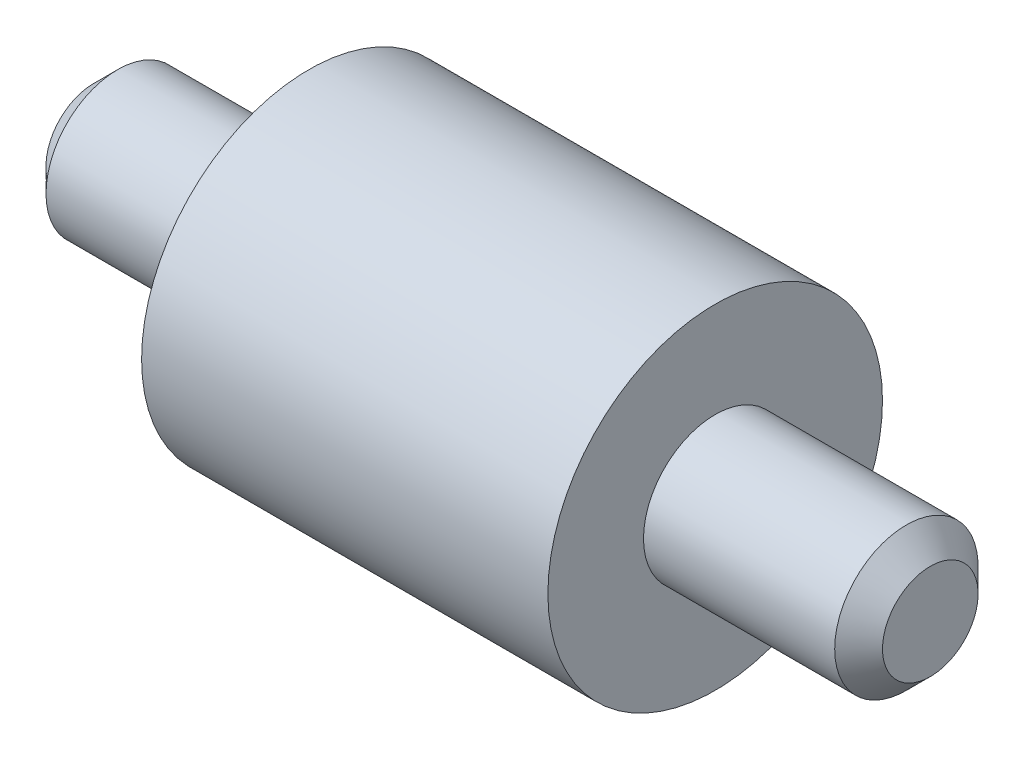
ISO-10303-21;
HEADER;
FILE_DESCRIPTION(('STEP AP214'),'2;1');
FILE_NAME('part.step','',(''),(''),'','','');
FILE_SCHEMA(('AUTOMOTIVE_DESIGN { 1 0 10303 214 1 1 1 1 }'));
ENDSEC;
DATA;
#1=APPLICATION_CONTEXT('core data for automotive mechanical design processes');
#2=APPLICATION_PROTOCOL_DEFINITION('international standard','automotive_design',2000,#1);
#3=PRODUCT_CONTEXT('',#1,'mechanical');
#4=PRODUCT('Part','Part','',(#3));
#5=PRODUCT_RELATED_PRODUCT_CATEGORY('part','',(#4));
#6=PRODUCT_DEFINITION_FORMATION('','',#4);
#7=PRODUCT_DEFINITION_CONTEXT('part definition',#1,'design');
#8=PRODUCT_DEFINITION('design','',#6,#7);
#9=PRODUCT_DEFINITION_SHAPE('','',#8);
#10=(LENGTH_UNIT() NAMED_UNIT(*) SI_UNIT(.MILLI.,.METRE.));
#11=(NAMED_UNIT(*) PLANE_ANGLE_UNIT() SI_UNIT($,.RADIAN.));
#12=(NAMED_UNIT(*) SI_UNIT($,.STERADIAN.) SOLID_ANGLE_UNIT());
#13=UNCERTAINTY_MEASURE_WITH_UNIT(LENGTH_MEASURE(1.E-05),#10,'distance_accuracy_value','');
#14=(GEOMETRIC_REPRESENTATION_CONTEXT(3) GLOBAL_UNCERTAINTY_ASSIGNED_CONTEXT((#13)) GLOBAL_UNIT_ASSIGNED_CONTEXT((#10,
#11,#12)) REPRESENTATION_CONTEXT('',''));
#15=CARTESIAN_POINT('',(0.,0.,0.));
#16=DIRECTION('',(0.,0.,1.));
#17=DIRECTION('',(1.,0.,0.));
#18=AXIS2_PLACEMENT_3D('',#15,#16,#17);
#19=CARTESIAN_POINT('',(35.,6.,0.));
#20=DIRECTION('',(-1.,0.,0.));
#21=DIRECTION('',(0.,0.,1.));
#22=AXIS2_PLACEMENT_3D('',#19,#20,#21);
#23=PLANE('',#22);
#24=CARTESIAN_POINT('',(35.,0.,0.));
#25=DIRECTION('',(-1.,0.,0.));
#26=DIRECTION('',(0.,0.,1.));
#27=AXIS2_PLACEMENT_3D('',#24,#25,#26);
#28=CIRCLE('',#27,4.);
#29=CARTESIAN_POINT('',(35.,0.,4.));
#30=VERTEX_POINT('',#29);
#31=EDGE_CURVE('E33',#30,#30,#28,.F.);
#32=ORIENTED_EDGE('',*,*,#31,.T.);
#33=EDGE_LOOP('',(#32));
#34=FACE_BOUND('',#33,.T.);
#35=ADVANCED_FACE('F22',(#34),#23,.F.);
#36=CARTESIAN_POINT('',(-35.,6.,0.));
#37=DIRECTION('',(1.,0.,0.));
#38=DIRECTION('',(0.,0.,-1.));
#39=AXIS2_PLACEMENT_3D('',#36,#37,#38);
#40=PLANE('',#39);
#41=CARTESIAN_POINT('',(-35.,0.,0.));
#42=DIRECTION('',(1.,0.,0.));
#43=DIRECTION('',(0.,0.,-1.));
#44=AXIS2_PLACEMENT_3D('',#41,#42,#43);
#45=CIRCLE('',#44,4.);
#46=CARTESIAN_POINT('',(-35.,0.,-4.));
#47=VERTEX_POINT('',#46);
#48=EDGE_CURVE('E29',#47,#47,#45,.F.);
#49=ORIENTED_EDGE('',*,*,#48,.T.);
#50=EDGE_LOOP('',(#49));
#51=FACE_BOUND('',#50,.T.);
#52=ADVANCED_FACE('F73',(#51),#40,.F.);
#53=CARTESIAN_POINT('',(0.,0.,0.));
#54=DIRECTION('',(-1.,0.,0.));
#55=DIRECTION('',(0.,0.,1.));
#56=AXIS2_PLACEMENT_3D('',#53,#54,#55);
#57=CYLINDRICAL_SURFACE('',#56,6.);
#58=CARTESIAN_POINT('',(-33.,0.,0.));
#59=DIRECTION('',(1.,0.,0.));
#60=DIRECTION('',(0.,0.,-1.));
#61=AXIS2_PLACEMENT_3D('',#58,#59,#60);
#62=CIRCLE('',#61,6.);
#63=CARTESIAN_POINT('',(-33.,0.,-6.));
#64=VERTEX_POINT('',#63);
#65=EDGE_CURVE('E12',#64,#64,#62,.T.);
#66=ORIENTED_EDGE('',*,*,#65,.T.);
#67=EDGE_LOOP('',(#66));
#68=FACE_BOUND('',#67,.T.);
#69=CARTESIAN_POINT('',(-17.,0.,0.));
#70=DIRECTION('',(-1.,0.,0.));
#71=DIRECTION('',(0.,0.,1.));
#72=AXIS2_PLACEMENT_3D('',#69,#70,#71);
#73=CIRCLE('',#72,6.);
#74=CARTESIAN_POINT('',(-17.,0.,6.));
#75=VERTEX_POINT('',#74);
#76=EDGE_CURVE('E42',#75,#75,#73,.T.);
#77=ORIENTED_EDGE('',*,*,#76,.T.);
#78=EDGE_LOOP('',(#77));
#79=FACE_BOUND('',#78,.T.);
#80=ADVANCED_FACE('F80',(#68,#79),#57,.T.);
#81=CARTESIAN_POINT('',(-17.,14.,0.));
#82=DIRECTION('',(1.,0.,0.));
#83=DIRECTION('',(0.,0.,-1.));
#84=AXIS2_PLACEMENT_3D('',#81,#82,#83);
#85=PLANE('',#84);
#86=ORIENTED_EDGE('',*,*,#76,.F.);
#87=EDGE_LOOP('',(#86));
#88=FACE_BOUND('',#87,.T.);
#89=CARTESIAN_POINT('',(-17.,0.,0.));
#90=DIRECTION('',(-1.,0.,0.));
#91=DIRECTION('',(0.,0.,1.));
#92=AXIS2_PLACEMENT_3D('',#89,#90,#91);
#93=CIRCLE('',#92,14.);
#94=CARTESIAN_POINT('',(-17.,0.,14.));
#95=VERTEX_POINT('',#94);
#96=EDGE_CURVE('E45',#95,#95,#93,.T.);
#97=ORIENTED_EDGE('',*,*,#96,.T.);
#98=EDGE_LOOP('',(#97));
#99=FACE_BOUND('',#98,.T.);
#100=ADVANCED_FACE('F85',(#88,#99),#85,.F.);
#101=CARTESIAN_POINT('',(0.,0.,0.));
#102=DIRECTION('',(-1.,0.,0.));
#103=DIRECTION('',(0.,0.,1.));
#104=AXIS2_PLACEMENT_3D('',#101,#102,#103);
#105=CYLINDRICAL_SURFACE('',#104,14.);
#106=ORIENTED_EDGE('',*,*,#96,.F.);
#107=EDGE_LOOP('',(#106));
#108=FACE_BOUND('',#107,.T.);
#109=CARTESIAN_POINT('',(17.,0.,0.));
#110=DIRECTION('',(-1.,0.,0.));
#111=DIRECTION('',(0.,0.,1.));
#112=AXIS2_PLACEMENT_3D('',#109,#110,#111);
#113=CIRCLE('',#112,14.);
#114=CARTESIAN_POINT('',(17.,0.,14.));
#115=VERTEX_POINT('',#114);
#116=EDGE_CURVE('E48',#115,#115,#113,.T.);
#117=ORIENTED_EDGE('',*,*,#116,.T.);
#118=EDGE_LOOP('',(#117));
#119=FACE_BOUND('',#118,.T.);
#120=ADVANCED_FACE('F69',(#108,#119),#105,.T.);
#121=CARTESIAN_POINT('',(17.,14.,0.));
#122=DIRECTION('',(-1.,0.,0.));
#123=DIRECTION('',(0.,0.,1.));
#124=AXIS2_PLACEMENT_3D('',#121,#122,#123);
#125=PLANE('',#124);
#126=ORIENTED_EDGE('',*,*,#116,.F.);
#127=EDGE_LOOP('',(#126));
#128=FACE_BOUND('',#127,.T.);
#129=CARTESIAN_POINT('',(17.,0.,0.));
#130=DIRECTION('',(-1.,0.,0.));
#131=DIRECTION('',(0.,0.,1.));
#132=AXIS2_PLACEMENT_3D('',#129,#130,#131);
#133=CIRCLE('',#132,6.);
#134=CARTESIAN_POINT('',(17.,0.,6.));
#135=VERTEX_POINT('',#134);
#136=EDGE_CURVE('E51',#135,#135,#133,.T.);
#137=ORIENTED_EDGE('',*,*,#136,.T.);
#138=EDGE_LOOP('',(#137));
#139=FACE_BOUND('',#138,.T.);
#140=ADVANCED_FACE('F55',(#128,#139),#125,.F.);
#141=CARTESIAN_POINT('',(0.,0.,0.));
#142=DIRECTION('',(-1.,0.,0.));
#143=DIRECTION('',(0.,0.,1.));
#144=AXIS2_PLACEMENT_3D('',#141,#142,#143);
#145=CYLINDRICAL_SURFACE('',#144,6.);
#146=CARTESIAN_POINT('',(33.,0.,0.));
#147=DIRECTION('',(-1.,0.,0.));
#148=DIRECTION('',(0.,0.,1.));
#149=AXIS2_PLACEMENT_3D('',#146,#147,#148);
#150=CIRCLE('',#149,6.);
#151=CARTESIAN_POINT('',(33.,0.,6.));
#152=VERTEX_POINT('',#151);
#153=EDGE_CURVE('E37',#152,#152,#150,.T.);
#154=ORIENTED_EDGE('',*,*,#153,.T.);
#155=EDGE_LOOP('',(#154));
#156=FACE_BOUND('',#155,.T.);
#157=ORIENTED_EDGE('',*,*,#136,.F.);
#158=EDGE_LOOP('',(#157));
#159=FACE_BOUND('',#158,.T.);
#160=ADVANCED_FACE('F57',(#156,#159),#145,.T.);
#161=CARTESIAN_POINT('',(33.,0.,0.));
#162=DIRECTION('',(-1.,0.,0.));
#163=DIRECTION('',(0.,0.,1.));
#164=AXIS2_PLACEMENT_3D('',#161,#162,#163);
#165=CONICAL_SURFACE('',#164,6.,0.78539816339745);
#166=ORIENTED_EDGE('',*,*,#31,.F.);
#167=EDGE_LOOP('',(#166));
#168=FACE_BOUND('',#167,.T.);
#169=ORIENTED_EDGE('',*,*,#153,.F.);
#170=EDGE_LOOP('',(#169));
#171=FACE_BOUND('',#170,.T.);
#172=ADVANCED_FACE('F59',(#168,#171),#165,.T.);
#173=CARTESIAN_POINT('',(-35.,0.,0.));
#174=DIRECTION('',(1.,0.,0.));
#175=DIRECTION('',(0.,0.,-1.));
#176=AXIS2_PLACEMENT_3D('',#173,#174,#175);
#177=CONICAL_SURFACE('',#176,4.,0.785398163397448);
#178=ORIENTED_EDGE('',*,*,#65,.F.);
#179=EDGE_LOOP('',(#178));
#180=FACE_BOUND('',#179,.T.);
#181=ORIENTED_EDGE('',*,*,#48,.F.);
#182=EDGE_LOOP('',(#181));
#183=FACE_BOUND('',#182,.T.);
#184=ADVANCED_FACE('F24',(#180,#183),#177,.T.);
#185=CLOSED_SHELL('',(#35,#52,#80,#100,#120,#140,#160,#172,#184));
#186=MANIFOLD_SOLID_BREP('B1',#185);
#187=ADVANCED_BREP_SHAPE_REPRESENTATION('',(#18,#186),#14);
#188=SHAPE_DEFINITION_REPRESENTATION(#9,#187);
ENDSEC;
END-ISO-10303-21;
